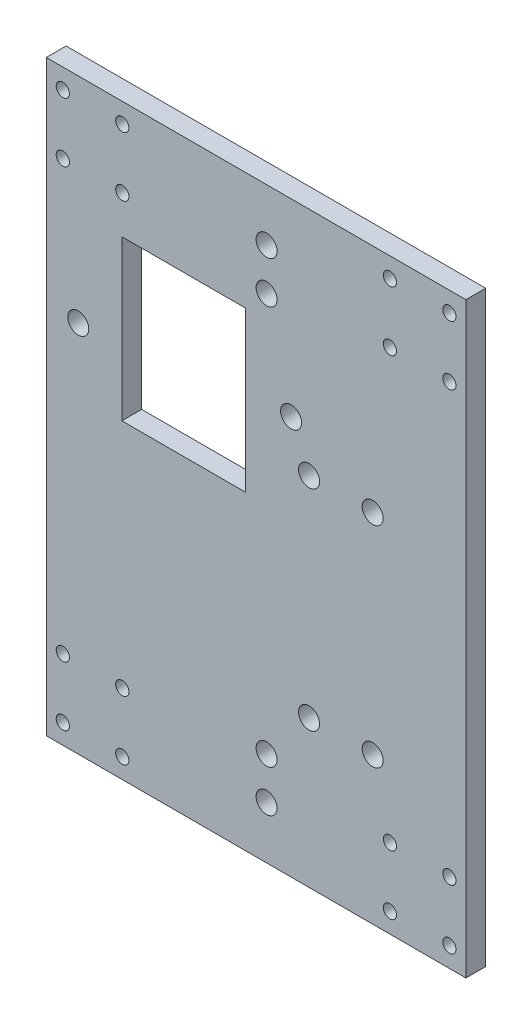
ISO-10303-21;
HEADER;
FILE_DESCRIPTION(('STEP AP214'),'2;1');
FILE_NAME('part.step','',(''),(''),'','','');
FILE_SCHEMA(('AUTOMOTIVE_DESIGN { 1 0 10303 214 1 1 1 1 }'));
ENDSEC;
DATA;
#1=APPLICATION_CONTEXT('core data for automotive mechanical design processes');
#2=APPLICATION_PROTOCOL_DEFINITION('international standard','automotive_design',2000,#1);
#3=PRODUCT_CONTEXT('',#1,'mechanical');
#4=PRODUCT('Part','Part','',(#3));
#5=PRODUCT_RELATED_PRODUCT_CATEGORY('part','',(#4));
#6=PRODUCT_DEFINITION_FORMATION('','',#4);
#7=PRODUCT_DEFINITION_CONTEXT('part definition',#1,'design');
#8=PRODUCT_DEFINITION('design','',#6,#7);
#9=PRODUCT_DEFINITION_SHAPE('','',#8);
#10=(LENGTH_UNIT() NAMED_UNIT(*) SI_UNIT(.MILLI.,.METRE.));
#11=(NAMED_UNIT(*) PLANE_ANGLE_UNIT() SI_UNIT($,.RADIAN.));
#12=(NAMED_UNIT(*) SI_UNIT($,.STERADIAN.) SOLID_ANGLE_UNIT());
#13=UNCERTAINTY_MEASURE_WITH_UNIT(LENGTH_MEASURE(1.E-05),#10,'distance_accuracy_value','');
#14=(GEOMETRIC_REPRESENTATION_CONTEXT(3) GLOBAL_UNCERTAINTY_ASSIGNED_CONTEXT((#13)) GLOBAL_UNIT_ASSIGNED_CONTEXT((#10,
#11,#12)) REPRESENTATION_CONTEXT('',''));
#15=CARTESIAN_POINT('',(0.,0.,0.));
#16=DIRECTION('',(0.,0.,1.));
#17=DIRECTION('',(1.,0.,0.));
#18=AXIS2_PLACEMENT_3D('',#15,#16,#17);
#19=CARTESIAN_POINT('',(0.,0.,5.9944));
#20=DIRECTION('',(0.,0.,-1.));
#21=DIRECTION('',(-1.,0.,0.));
#22=AXIS2_PLACEMENT_3D('',#19,#20,#21);
#23=PLANE('',#22);
#24=CARTESIAN_POINT('',(66.675,149.225,5.9944));
#25=DIRECTION('',(0.,0.,1.));
#26=DIRECTION('',(1.,0.,0.));
#27=AXIS2_PLACEMENT_3D('',#24,#25,#26);
#28=CIRCLE('',#27,3.175);
#29=CARTESIAN_POINT('',(69.85,149.225,5.9944));
#30=VERTEX_POINT('',#29);
#31=EDGE_CURVE('E373',#30,#30,#28,.T.);
#32=ORIENTED_EDGE('',*,*,#31,.F.);
#33=EDGE_LOOP('',(#32));
#34=FACE_BOUND('',#33,.T.);
#35=CARTESIAN_POINT('',(66.675,15.875,5.9944));
#36=DIRECTION('',(0.,0.,1.));
#37=DIRECTION('',(1.,0.,0.));
#38=AXIS2_PLACEMENT_3D('',#35,#36,#37);
#39=CIRCLE('',#38,3.175);
#40=CARTESIAN_POINT('',(69.85,15.875,5.9944));
#41=VERTEX_POINT('',#40);
#42=EDGE_CURVE('E383',#41,#41,#39,.T.);
#43=ORIENTED_EDGE('',*,*,#42,.F.);
#44=EDGE_LOOP('',(#43));
#45=FACE_BOUND('',#44,.T.);
#46=CARTESIAN_POINT('',(9.6774,113.03,5.9944));
#47=DIRECTION('',(0.,0.,1.));
#48=DIRECTION('',(1.,0.,0.));
#49=AXIS2_PLACEMENT_3D('',#46,#47,#48);
#50=CIRCLE('',#49,3.175);
#51=CARTESIAN_POINT('',(12.8524,113.03,5.9944));
#52=VERTEX_POINT('',#51);
#53=EDGE_CURVE('E126',#52,#52,#50,.T.);
#54=ORIENTED_EDGE('',*,*,#53,.F.);
#55=EDGE_LOOP('',(#54));
#56=FACE_BOUND('',#55,.T.);
#57=CARTESIAN_POINT('',(98.7806,107.95,5.9944));
#58=DIRECTION('',(0.,0.,1.));
#59=DIRECTION('',(1.,0.,0.));
#60=AXIS2_PLACEMENT_3D('',#57,#58,#59);
#61=CIRCLE('',#60,3.175);
#62=CARTESIAN_POINT('',(101.9556,107.95,5.9944));
#63=VERTEX_POINT('',#62);
#64=EDGE_CURVE('E136',#63,#63,#61,.T.);
#65=ORIENTED_EDGE('',*,*,#64,.F.);
#66=EDGE_LOOP('',(#65));
#67=FACE_BOUND('',#66,.T.);
#68=CARTESIAN_POINT('',(79.5274,44.45,5.9944));
#69=DIRECTION('',(0.,0.,1.));
#70=DIRECTION('',(1.,0.,0.));
#71=AXIS2_PLACEMENT_3D('',#68,#69,#70);
#72=CIRCLE('',#71,3.175);
#73=CARTESIAN_POINT('',(82.7024,44.45,5.9944));
#74=VERTEX_POINT('',#73);
#75=EDGE_CURVE('E148',#74,#74,#72,.T.);
#76=ORIENTED_EDGE('',*,*,#75,.F.);
#77=EDGE_LOOP('',(#76));
#78=FACE_BOUND('',#77,.T.);
#79=CARTESIAN_POINT('',(122.,6.,5.9944));
#80=DIRECTION('',(0.,0.,1.));
#81=DIRECTION('',(1.,0.,0.));
#82=AXIS2_PLACEMENT_3D('',#79,#80,#81);
#83=CIRCLE('',#82,2.);
#84=CARTESIAN_POINT('',(124.,6.,5.9944));
#85=VERTEX_POINT('',#84);
#86=EDGE_CURVE('E160',#85,#85,#83,.T.);
#87=ORIENTED_EDGE('',*,*,#86,.F.);
#88=EDGE_LOOP('',(#87));
#89=FACE_BOUND('',#88,.T.);
#90=CARTESIAN_POINT('',(104.,24.,5.9944));
#91=DIRECTION('',(0.,0.,1.));
#92=DIRECTION('',(1.,0.,0.));
#93=AXIS2_PLACEMENT_3D('',#90,#91,#92);
#94=CIRCLE('',#93,2.);
#95=CARTESIAN_POINT('',(106.,24.,5.9944));
#96=VERTEX_POINT('',#95);
#97=EDGE_CURVE('E172',#96,#96,#94,.T.);
#98=ORIENTED_EDGE('',*,*,#97,.F.);
#99=EDGE_LOOP('',(#98));
#100=FACE_BOUND('',#99,.T.);
#101=CARTESIAN_POINT('',(23.,6.,5.9944));
#102=DIRECTION('',(0.,0.,1.));
#103=DIRECTION('',(1.,0.,0.));
#104=AXIS2_PLACEMENT_3D('',#101,#102,#103);
#105=CIRCLE('',#104,2.);
#106=CARTESIAN_POINT('',(25.,6.,5.9944));
#107=VERTEX_POINT('',#106);
#108=EDGE_CURVE('E184',#107,#107,#105,.T.);
#109=ORIENTED_EDGE('',*,*,#108,.F.);
#110=EDGE_LOOP('',(#109));
#111=FACE_BOUND('',#110,.T.);
#112=CARTESIAN_POINT('',(5.,24.,5.9944));
#113=DIRECTION('',(0.,0.,1.));
#114=DIRECTION('',(1.,0.,0.));
#115=AXIS2_PLACEMENT_3D('',#112,#113,#114);
#116=CIRCLE('',#115,2.);
#117=CARTESIAN_POINT('',(7.,24.,5.9944));
#118=VERTEX_POINT('',#117);
#119=EDGE_CURVE('E196',#118,#118,#116,.T.);
#120=ORIENTED_EDGE('',*,*,#119,.F.);
#121=EDGE_LOOP('',(#120));
#122=FACE_BOUND('',#121,.T.);
#123=CARTESIAN_POINT('',(122.,153.8,5.9944));
#124=DIRECTION('',(0.,0.,1.));
#125=DIRECTION('',(1.,0.,0.));
#126=AXIS2_PLACEMENT_3D('',#123,#124,#125);
#127=CIRCLE('',#126,2.);
#128=CARTESIAN_POINT('',(124.,153.8,5.9944));
#129=VERTEX_POINT('',#128);
#130=EDGE_CURVE('E208',#129,#129,#127,.T.);
#131=ORIENTED_EDGE('',*,*,#130,.F.);
#132=EDGE_LOOP('',(#131));
#133=FACE_BOUND('',#132,.T.);
#134=CARTESIAN_POINT('',(122.,171.8,5.9944));
#135=DIRECTION('',(0.,0.,1.));
#136=DIRECTION('',(1.,0.,0.));
#137=AXIS2_PLACEMENT_3D('',#134,#135,#136);
#138=CIRCLE('',#137,2.);
#139=CARTESIAN_POINT('',(124.,171.8,5.9944));
#140=VERTEX_POINT('',#139);
#141=EDGE_CURVE('E220',#140,#140,#138,.T.);
#142=ORIENTED_EDGE('',*,*,#141,.F.);
#143=EDGE_LOOP('',(#142));
#144=FACE_BOUND('',#143,.T.);
#145=CARTESIAN_POINT('',(23.,153.8,5.9944));
#146=DIRECTION('',(0.,0.,1.));
#147=DIRECTION('',(1.,0.,0.));
#148=AXIS2_PLACEMENT_3D('',#145,#146,#147);
#149=CIRCLE('',#148,2.00000000000001);
#150=CARTESIAN_POINT('',(25.,153.8,5.9944));
#151=VERTEX_POINT('',#150);
#152=EDGE_CURVE('E232',#151,#151,#149,.T.);
#153=ORIENTED_EDGE('',*,*,#152,.F.);
#154=EDGE_LOOP('',(#153));
#155=FACE_BOUND('',#154,.T.);
#156=CARTESIAN_POINT('',(23.,171.8,5.9944));
#157=DIRECTION('',(0.,0.,1.));
#158=DIRECTION('',(1.,0.,0.));
#159=AXIS2_PLACEMENT_3D('',#156,#157,#158);
#160=CIRCLE('',#159,2.00000000000001);
#161=CARTESIAN_POINT('',(25.,171.8,5.9944));
#162=VERTEX_POINT('',#161);
#163=EDGE_CURVE('E244',#162,#162,#160,.T.);
#164=ORIENTED_EDGE('',*,*,#163,.F.);
#165=EDGE_LOOP('',(#164));
#166=FACE_BOUND('',#165,.T.);
#167=DIRECTION('',(0.,-1.,0.));
#168=VECTOR('',#167,1.);
#169=CARTESIAN_POINT('',(0.,0.,5.9944));
#170=LINE('',#169,#168);
#171=CARTESIAN_POINT('',(0.,177.8,5.9944));
#172=VERTEX_POINT('',#171);
#173=CARTESIAN_POINT('',(0.,0.,5.9944));
#174=VERTEX_POINT('',#173);
#175=EDGE_CURVE('E256',#172,#174,#170,.T.);
#176=ORIENTED_EDGE('',*,*,#175,.T.);
#177=DIRECTION('',(1.,0.,0.));
#178=VECTOR('',#177,1.);
#179=CARTESIAN_POINT('',(0.,0.,5.9944));
#180=LINE('',#179,#178);
#181=CARTESIAN_POINT('',(127.,0.,5.9944));
#182=VERTEX_POINT('',#181);
#183=EDGE_CURVE('E259',#174,#182,#180,.T.);
#184=ORIENTED_EDGE('',*,*,#183,.T.);
#185=DIRECTION('',(0.,1.,0.));
#186=VECTOR('',#185,1.);
#187=CARTESIAN_POINT('',(127.,0.,5.9944));
#188=LINE('',#187,#186);
#189=CARTESIAN_POINT('',(127.,177.8,5.9944));
#190=VERTEX_POINT('',#189);
#191=EDGE_CURVE('E262',#182,#190,#188,.T.);
#192=ORIENTED_EDGE('',*,*,#191,.T.);
#193=DIRECTION('',(-1.,0.,0.));
#194=VECTOR('',#193,1.);
#195=CARTESIAN_POINT('',(0.,177.8,5.9944));
#196=LINE('',#195,#194);
#197=EDGE_CURVE('E264',#190,#172,#196,.T.);
#198=ORIENTED_EDGE('',*,*,#197,.T.);
#199=EDGE_LOOP('',(#176,#184,#192,#198));
#200=FACE_BOUND('',#199,.T.);
#201=CARTESIAN_POINT('',(5.,171.8,5.9944));
#202=DIRECTION('',(0.,0.,1.));
#203=DIRECTION('',(1.,0.,0.));
#204=AXIS2_PLACEMENT_3D('',#201,#202,#203);
#205=CIRCLE('',#204,2.);
#206=CARTESIAN_POINT('',(7.,171.8,5.9944));
#207=VERTEX_POINT('',#206);
#208=EDGE_CURVE('E250',#207,#207,#205,.T.);
#209=ORIENTED_EDGE('',*,*,#208,.F.);
#210=EDGE_LOOP('',(#209));
#211=FACE_BOUND('',#210,.T.);
#212=CARTESIAN_POINT('',(5.,153.8,5.9944));
#213=DIRECTION('',(0.,0.,1.));
#214=DIRECTION('',(1.,0.,0.));
#215=AXIS2_PLACEMENT_3D('',#212,#213,#214);
#216=CIRCLE('',#215,2.);
#217=CARTESIAN_POINT('',(7.,153.8,5.9944));
#218=VERTEX_POINT('',#217);
#219=EDGE_CURVE('E238',#218,#218,#216,.T.);
#220=ORIENTED_EDGE('',*,*,#219,.F.);
#221=EDGE_LOOP('',(#220));
#222=FACE_BOUND('',#221,.T.);
#223=CARTESIAN_POINT('',(104.,171.8,5.9944));
#224=DIRECTION('',(0.,0.,1.));
#225=DIRECTION('',(1.,0.,0.));
#226=AXIS2_PLACEMENT_3D('',#223,#224,#225);
#227=CIRCLE('',#226,2.);
#228=CARTESIAN_POINT('',(106.,171.8,5.9944));
#229=VERTEX_POINT('',#228);
#230=EDGE_CURVE('E226',#229,#229,#227,.T.);
#231=ORIENTED_EDGE('',*,*,#230,.F.);
#232=EDGE_LOOP('',(#231));
#233=FACE_BOUND('',#232,.T.);
#234=CARTESIAN_POINT('',(104.,153.8,5.9944));
#235=DIRECTION('',(0.,0.,1.));
#236=DIRECTION('',(1.,0.,0.));
#237=AXIS2_PLACEMENT_3D('',#234,#235,#236);
#238=CIRCLE('',#237,2.);
#239=CARTESIAN_POINT('',(106.,153.8,5.9944));
#240=VERTEX_POINT('',#239);
#241=EDGE_CURVE('E214',#240,#240,#238,.T.);
#242=ORIENTED_EDGE('',*,*,#241,.F.);
#243=EDGE_LOOP('',(#242));
#244=FACE_BOUND('',#243,.T.);
#245=CARTESIAN_POINT('',(23.,24.,5.9944));
#246=DIRECTION('',(0.,0.,1.));
#247=DIRECTION('',(1.,0.,0.));
#248=AXIS2_PLACEMENT_3D('',#245,#246,#247);
#249=CIRCLE('',#248,2.);
#250=CARTESIAN_POINT('',(25.,24.,5.9944));
#251=VERTEX_POINT('',#250);
#252=EDGE_CURVE('E202',#251,#251,#249,.T.);
#253=ORIENTED_EDGE('',*,*,#252,.F.);
#254=EDGE_LOOP('',(#253));
#255=FACE_BOUND('',#254,.T.);
#256=CARTESIAN_POINT('',(5.,6.,5.9944));
#257=DIRECTION('',(0.,0.,1.));
#258=DIRECTION('',(1.,0.,0.));
#259=AXIS2_PLACEMENT_3D('',#256,#257,#258);
#260=CIRCLE('',#259,2.);
#261=CARTESIAN_POINT('',(7.,6.,5.9944));
#262=VERTEX_POINT('',#261);
#263=EDGE_CURVE('E190',#262,#262,#260,.T.);
#264=ORIENTED_EDGE('',*,*,#263,.F.);
#265=EDGE_LOOP('',(#264));
#266=FACE_BOUND('',#265,.T.);
#267=CARTESIAN_POINT('',(122.,24.,5.9944));
#268=DIRECTION('',(0.,0.,1.));
#269=DIRECTION('',(1.,0.,0.));
#270=AXIS2_PLACEMENT_3D('',#267,#268,#269);
#271=CIRCLE('',#270,2.);
#272=CARTESIAN_POINT('',(124.,24.,5.9944));
#273=VERTEX_POINT('',#272);
#274=EDGE_CURVE('E178',#273,#273,#271,.T.);
#275=ORIENTED_EDGE('',*,*,#274,.F.);
#276=EDGE_LOOP('',(#275));
#277=FACE_BOUND('',#276,.T.);
#278=CARTESIAN_POINT('',(104.,6.,5.9944));
#279=DIRECTION('',(0.,0.,1.));
#280=DIRECTION('',(1.,0.,0.));
#281=AXIS2_PLACEMENT_3D('',#278,#279,#280);
#282=CIRCLE('',#281,2.);
#283=CARTESIAN_POINT('',(106.,6.,5.9944));
#284=VERTEX_POINT('',#283);
#285=EDGE_CURVE('E166',#284,#284,#282,.T.);
#286=ORIENTED_EDGE('',*,*,#285,.F.);
#287=EDGE_LOOP('',(#286));
#288=FACE_BOUND('',#287,.T.);
#289=CARTESIAN_POINT('',(98.7806,44.45,5.9944));
#290=DIRECTION('',(0.,0.,1.));
#291=DIRECTION('',(1.,0.,0.));
#292=AXIS2_PLACEMENT_3D('',#289,#290,#291);
#293=CIRCLE('',#292,3.175);
#294=CARTESIAN_POINT('',(101.9556,44.45,5.9944));
#295=VERTEX_POINT('',#294);
#296=EDGE_CURVE('E154',#295,#295,#293,.T.);
#297=ORIENTED_EDGE('',*,*,#296,.F.);
#298=EDGE_LOOP('',(#297));
#299=FACE_BOUND('',#298,.T.);
#300=CARTESIAN_POINT('',(79.5274,107.95,5.9944));
#301=DIRECTION('',(0.,0.,1.));
#302=DIRECTION('',(1.,0.,0.));
#303=AXIS2_PLACEMENT_3D('',#300,#301,#302);
#304=CIRCLE('',#303,3.175);
#305=CARTESIAN_POINT('',(82.7024,107.95,5.9944));
#306=VERTEX_POINT('',#305);
#307=EDGE_CURVE('E142',#306,#306,#304,.T.);
#308=ORIENTED_EDGE('',*,*,#307,.F.);
#309=EDGE_LOOP('',(#308));
#310=FACE_BOUND('',#309,.T.);
#311=DIRECTION('',(0.,-1.,0.));
#312=VECTOR('',#311,1.);
#313=CARTESIAN_POINT('',(22.86,142.24,5.9944));
#314=LINE('',#313,#312);
#315=CARTESIAN_POINT('',(22.86,142.24,5.9944));
#316=VERTEX_POINT('',#315);
#317=CARTESIAN_POINT('',(22.86,93.98,5.9944));
#318=VERTEX_POINT('',#317);
#319=EDGE_CURVE('E97',#316,#318,#314,.T.);
#320=ORIENTED_EDGE('',*,*,#319,.F.);
#321=DIRECTION('',(-1.,0.,0.));
#322=VECTOR('',#321,1.);
#323=CARTESIAN_POINT('',(22.86,142.24,5.9944));
#324=LINE('',#323,#322);
#325=CARTESIAN_POINT('',(60.325,142.24,5.9944));
#326=VERTEX_POINT('',#325);
#327=EDGE_CURVE('E120',#326,#316,#324,.T.);
#328=ORIENTED_EDGE('',*,*,#327,.F.);
#329=DIRECTION('',(0.,1.,0.));
#330=VECTOR('',#329,1.);
#331=CARTESIAN_POINT('',(60.325,142.24,5.9944));
#332=LINE('',#331,#330);
#333=CARTESIAN_POINT('',(60.325,93.98,5.9944));
#334=VERTEX_POINT('',#333);
#335=EDGE_CURVE('E118',#334,#326,#332,.T.);
#336=ORIENTED_EDGE('',*,*,#335,.F.);
#337=DIRECTION('',(1.,0.,0.));
#338=VECTOR('',#337,1.);
#339=CARTESIAN_POINT('',(22.86,93.98,5.9944));
#340=LINE('',#339,#338);
#341=EDGE_CURVE('E105',#318,#334,#340,.T.);
#342=ORIENTED_EDGE('',*,*,#341,.F.);
#343=EDGE_LOOP('',(#320,#328,#336,#342));
#344=FACE_BOUND('',#343,.T.);
#345=CARTESIAN_POINT('',(74.0918,120.65,5.9944));
#346=DIRECTION('',(0.,0.,1.));
#347=DIRECTION('',(1.,0.,0.));
#348=AXIS2_PLACEMENT_3D('',#345,#346,#347);
#349=CIRCLE('',#348,3.175);
#350=CARTESIAN_POINT('',(77.2668,120.65,5.9944));
#351=VERTEX_POINT('',#350);
#352=EDGE_CURVE('E388',#351,#351,#349,.T.);
#353=ORIENTED_EDGE('',*,*,#352,.F.);
#354=EDGE_LOOP('',(#353));
#355=FACE_BOUND('',#354,.T.);
#356=CARTESIAN_POINT('',(66.675,161.925,5.9944));
#357=DIRECTION('',(0.,0.,1.));
#358=DIRECTION('',(1.,0.,0.));
#359=AXIS2_PLACEMENT_3D('',#356,#357,#358);
#360=CIRCLE('',#359,3.175);
#361=CARTESIAN_POINT('',(69.85,161.925,5.9944));
#362=VERTEX_POINT('',#361);
#363=EDGE_CURVE('E378',#362,#362,#360,.T.);
#364=ORIENTED_EDGE('',*,*,#363,.F.);
#365=EDGE_LOOP('',(#364));
#366=FACE_BOUND('',#365,.T.);
#367=CARTESIAN_POINT('',(66.675,28.575,5.9944));
#368=DIRECTION('',(0.,0.,1.));
#369=DIRECTION('',(1.,0.,0.));
#370=AXIS2_PLACEMENT_3D('',#367,#368,#369);
#371=CIRCLE('',#370,3.175);
#372=CARTESIAN_POINT('',(69.85,28.575,5.9944));
#373=VERTEX_POINT('',#372);
#374=EDGE_CURVE('E367',#373,#373,#371,.T.);
#375=ORIENTED_EDGE('',*,*,#374,.F.);
#376=EDGE_LOOP('',(#375));
#377=FACE_BOUND('',#376,.T.);
#378=ADVANCED_FACE('F32',(#34,#45,#56,#67,#78,#89,#100,#111,#122,#133,#144,#155,#166,#200,#211,
#222,#233,#244,#255,#266,#277,#288,#299,#310,#344,#355,#366,#377),#23,.F.);
#379=CARTESIAN_POINT('',(0.,0.,0.));
#380=DIRECTION('',(0.,0.,-1.));
#381=DIRECTION('',(-1.,0.,0.));
#382=AXIS2_PLACEMENT_3D('',#379,#380,#381);
#383=PLANE('',#382);
#384=CARTESIAN_POINT('',(66.675,149.225,0.));
#385=DIRECTION('',(0.,0.,1.));
#386=DIRECTION('',(1.,0.,0.));
#387=AXIS2_PLACEMENT_3D('',#384,#385,#386);
#388=CIRCLE('',#387,3.175);
#389=CARTESIAN_POINT('',(69.85,149.225,0.));
#390=VERTEX_POINT('',#389);
#391=EDGE_CURVE('E370',#390,#390,#388,.T.);
#392=ORIENTED_EDGE('',*,*,#391,.T.);
#393=EDGE_LOOP('',(#392));
#394=FACE_BOUND('',#393,.T.);
#395=CARTESIAN_POINT('',(66.675,15.875,0.));
#396=DIRECTION('',(0.,0.,1.));
#397=DIRECTION('',(1.,0.,0.));
#398=AXIS2_PLACEMENT_3D('',#395,#396,#397);
#399=CIRCLE('',#398,3.175);
#400=CARTESIAN_POINT('',(69.85,15.875,0.));
#401=VERTEX_POINT('',#400);
#402=EDGE_CURVE('E381',#401,#401,#399,.T.);
#403=ORIENTED_EDGE('',*,*,#402,.T.);
#404=EDGE_LOOP('',(#403));
#405=FACE_BOUND('',#404,.T.);
#406=CARTESIAN_POINT('',(9.6774,113.03,0.));
#407=DIRECTION('',(0.,0.,1.));
#408=DIRECTION('',(1.,0.,0.));
#409=AXIS2_PLACEMENT_3D('',#406,#407,#408);
#410=CIRCLE('',#409,3.175);
#411=CARTESIAN_POINT('',(12.8524,113.03,0.));
#412=VERTEX_POINT('',#411);
#413=EDGE_CURVE('E391',#412,#412,#410,.T.);
#414=ORIENTED_EDGE('',*,*,#413,.T.);
#415=EDGE_LOOP('',(#414));
#416=FACE_BOUND('',#415,.T.);
#417=CARTESIAN_POINT('',(98.7806,107.95,0.));
#418=DIRECTION('',(0.,0.,1.));
#419=DIRECTION('',(1.,0.,0.));
#420=AXIS2_PLACEMENT_3D('',#417,#418,#419);
#421=CIRCLE('',#420,3.175);
#422=CARTESIAN_POINT('',(101.9556,107.95,0.));
#423=VERTEX_POINT('',#422);
#424=EDGE_CURVE('E113',#423,#423,#421,.T.);
#425=ORIENTED_EDGE('',*,*,#424,.T.);
#426=EDGE_LOOP('',(#425));
#427=FACE_BOUND('',#426,.T.);
#428=CARTESIAN_POINT('',(79.5274,44.45,0.));
#429=DIRECTION('',(0.,0.,1.));
#430=DIRECTION('',(1.,0.,0.));
#431=AXIS2_PLACEMENT_3D('',#428,#429,#430);
#432=CIRCLE('',#431,3.175);
#433=CARTESIAN_POINT('',(82.7024,44.45,0.));
#434=VERTEX_POINT('',#433);
#435=EDGE_CURVE('E145',#434,#434,#432,.T.);
#436=ORIENTED_EDGE('',*,*,#435,.T.);
#437=EDGE_LOOP('',(#436));
#438=FACE_BOUND('',#437,.T.);
#439=CARTESIAN_POINT('',(122.,6.,0.));
#440=DIRECTION('',(0.,0.,1.));
#441=DIRECTION('',(1.,0.,0.));
#442=AXIS2_PLACEMENT_3D('',#439,#440,#441);
#443=CIRCLE('',#442,2.);
#444=CARTESIAN_POINT('',(124.,6.,0.));
#445=VERTEX_POINT('',#444);
#446=EDGE_CURVE('E157',#445,#445,#443,.T.);
#447=ORIENTED_EDGE('',*,*,#446,.T.);
#448=EDGE_LOOP('',(#447));
#449=FACE_BOUND('',#448,.T.);
#450=CARTESIAN_POINT('',(104.,24.,0.));
#451=DIRECTION('',(0.,0.,1.));
#452=DIRECTION('',(1.,0.,0.));
#453=AXIS2_PLACEMENT_3D('',#450,#451,#452);
#454=CIRCLE('',#453,2.);
#455=CARTESIAN_POINT('',(106.,24.,0.));
#456=VERTEX_POINT('',#455);
#457=EDGE_CURVE('E169',#456,#456,#454,.T.);
#458=ORIENTED_EDGE('',*,*,#457,.T.);
#459=EDGE_LOOP('',(#458));
#460=FACE_BOUND('',#459,.T.);
#461=CARTESIAN_POINT('',(23.,6.,0.));
#462=DIRECTION('',(0.,0.,1.));
#463=DIRECTION('',(1.,0.,0.));
#464=AXIS2_PLACEMENT_3D('',#461,#462,#463);
#465=CIRCLE('',#464,2.);
#466=CARTESIAN_POINT('',(25.,6.,0.));
#467=VERTEX_POINT('',#466);
#468=EDGE_CURVE('E181',#467,#467,#465,.T.);
#469=ORIENTED_EDGE('',*,*,#468,.T.);
#470=EDGE_LOOP('',(#469));
#471=FACE_BOUND('',#470,.T.);
#472=CARTESIAN_POINT('',(5.,24.,0.));
#473=DIRECTION('',(0.,0.,1.));
#474=DIRECTION('',(1.,0.,0.));
#475=AXIS2_PLACEMENT_3D('',#472,#473,#474);
#476=CIRCLE('',#475,2.);
#477=CARTESIAN_POINT('',(7.,24.,0.));
#478=VERTEX_POINT('',#477);
#479=EDGE_CURVE('E193',#478,#478,#476,.T.);
#480=ORIENTED_EDGE('',*,*,#479,.T.);
#481=EDGE_LOOP('',(#480));
#482=FACE_BOUND('',#481,.T.);
#483=CARTESIAN_POINT('',(122.,153.8,0.));
#484=DIRECTION('',(0.,0.,1.));
#485=DIRECTION('',(1.,0.,0.));
#486=AXIS2_PLACEMENT_3D('',#483,#484,#485);
#487=CIRCLE('',#486,2.);
#488=CARTESIAN_POINT('',(124.,153.8,0.));
#489=VERTEX_POINT('',#488);
#490=EDGE_CURVE('E205',#489,#489,#487,.T.);
#491=ORIENTED_EDGE('',*,*,#490,.T.);
#492=EDGE_LOOP('',(#491));
#493=FACE_BOUND('',#492,.T.);
#494=CARTESIAN_POINT('',(122.,171.8,0.));
#495=DIRECTION('',(0.,0.,1.));
#496=DIRECTION('',(1.,0.,0.));
#497=AXIS2_PLACEMENT_3D('',#494,#495,#496);
#498=CIRCLE('',#497,2.);
#499=CARTESIAN_POINT('',(124.,171.8,0.));
#500=VERTEX_POINT('',#499);
#501=EDGE_CURVE('E217',#500,#500,#498,.T.);
#502=ORIENTED_EDGE('',*,*,#501,.T.);
#503=EDGE_LOOP('',(#502));
#504=FACE_BOUND('',#503,.T.);
#505=CARTESIAN_POINT('',(23.,153.8,0.));
#506=DIRECTION('',(0.,0.,1.));
#507=DIRECTION('',(1.,0.,0.));
#508=AXIS2_PLACEMENT_3D('',#505,#506,#507);
#509=CIRCLE('',#508,2.00000000000001);
#510=CARTESIAN_POINT('',(25.,153.8,0.));
#511=VERTEX_POINT('',#510);
#512=EDGE_CURVE('E229',#511,#511,#509,.T.);
#513=ORIENTED_EDGE('',*,*,#512,.T.);
#514=EDGE_LOOP('',(#513));
#515=FACE_BOUND('',#514,.T.);
#516=CARTESIAN_POINT('',(23.,171.8,0.));
#517=DIRECTION('',(0.,0.,1.));
#518=DIRECTION('',(1.,0.,0.));
#519=AXIS2_PLACEMENT_3D('',#516,#517,#518);
#520=CIRCLE('',#519,2.00000000000001);
#521=CARTESIAN_POINT('',(25.,171.8,0.));
#522=VERTEX_POINT('',#521);
#523=EDGE_CURVE('E241',#522,#522,#520,.T.);
#524=ORIENTED_EDGE('',*,*,#523,.T.);
#525=EDGE_LOOP('',(#524));
#526=FACE_BOUND('',#525,.T.);
#527=DIRECTION('',(0.,-1.,0.));
#528=VECTOR('',#527,1.);
#529=CARTESIAN_POINT('',(0.,0.,0.));
#530=LINE('',#529,#528);
#531=CARTESIAN_POINT('',(0.,177.8,0.));
#532=VERTEX_POINT('',#531);
#533=CARTESIAN_POINT('',(0.,0.,0.));
#534=VERTEX_POINT('',#533);
#535=EDGE_CURVE('E253',#532,#534,#530,.T.);
#536=ORIENTED_EDGE('',*,*,#535,.F.);
#537=DIRECTION('',(-1.,0.,0.));
#538=VECTOR('',#537,1.);
#539=CARTESIAN_POINT('',(0.,177.8,0.));
#540=LINE('',#539,#538);
#541=CARTESIAN_POINT('',(127.,177.8,0.));
#542=VERTEX_POINT('',#541);
#543=EDGE_CURVE('E260',#542,#532,#540,.T.);
#544=ORIENTED_EDGE('',*,*,#543,.F.);
#545=DIRECTION('',(0.,1.,0.));
#546=VECTOR('',#545,1.);
#547=CARTESIAN_POINT('',(127.,0.,0.));
#548=LINE('',#547,#546);
#549=CARTESIAN_POINT('',(127.,0.,0.));
#550=VERTEX_POINT('',#549);
#551=EDGE_CURVE('E271',#550,#542,#548,.T.);
#552=ORIENTED_EDGE('',*,*,#551,.F.);
#553=DIRECTION('',(1.,0.,0.));
#554=VECTOR('',#553,1.);
#555=CARTESIAN_POINT('',(0.,0.,0.));
#556=LINE('',#555,#554);
#557=EDGE_CURVE('E269',#534,#550,#556,.T.);
#558=ORIENTED_EDGE('',*,*,#557,.F.);
#559=EDGE_LOOP('',(#536,#544,#552,#558));
#560=FACE_BOUND('',#559,.T.);
#561=CARTESIAN_POINT('',(5.,171.8,0.));
#562=DIRECTION('',(0.,0.,1.));
#563=DIRECTION('',(1.,0.,0.));
#564=AXIS2_PLACEMENT_3D('',#561,#562,#563);
#565=CIRCLE('',#564,2.);
#566=CARTESIAN_POINT('',(7.,171.8,0.));
#567=VERTEX_POINT('',#566);
#568=EDGE_CURVE('E247',#567,#567,#565,.T.);
#569=ORIENTED_EDGE('',*,*,#568,.T.);
#570=EDGE_LOOP('',(#569));
#571=FACE_BOUND('',#570,.T.);
#572=CARTESIAN_POINT('',(5.,153.8,0.));
#573=DIRECTION('',(0.,0.,1.));
#574=DIRECTION('',(1.,0.,0.));
#575=AXIS2_PLACEMENT_3D('',#572,#573,#574);
#576=CIRCLE('',#575,2.);
#577=CARTESIAN_POINT('',(7.,153.8,0.));
#578=VERTEX_POINT('',#577);
#579=EDGE_CURVE('E235',#578,#578,#576,.T.);
#580=ORIENTED_EDGE('',*,*,#579,.T.);
#581=EDGE_LOOP('',(#580));
#582=FACE_BOUND('',#581,.T.);
#583=CARTESIAN_POINT('',(104.,171.8,0.));
#584=DIRECTION('',(0.,0.,1.));
#585=DIRECTION('',(1.,0.,0.));
#586=AXIS2_PLACEMENT_3D('',#583,#584,#585);
#587=CIRCLE('',#586,2.);
#588=CARTESIAN_POINT('',(106.,171.8,0.));
#589=VERTEX_POINT('',#588);
#590=EDGE_CURVE('E223',#589,#589,#587,.T.);
#591=ORIENTED_EDGE('',*,*,#590,.T.);
#592=EDGE_LOOP('',(#591));
#593=FACE_BOUND('',#592,.T.);
#594=CARTESIAN_POINT('',(104.,153.8,0.));
#595=DIRECTION('',(0.,0.,1.));
#596=DIRECTION('',(1.,0.,0.));
#597=AXIS2_PLACEMENT_3D('',#594,#595,#596);
#598=CIRCLE('',#597,2.);
#599=CARTESIAN_POINT('',(106.,153.8,0.));
#600=VERTEX_POINT('',#599);
#601=EDGE_CURVE('E211',#600,#600,#598,.T.);
#602=ORIENTED_EDGE('',*,*,#601,.T.);
#603=EDGE_LOOP('',(#602));
#604=FACE_BOUND('',#603,.T.);
#605=CARTESIAN_POINT('',(23.,24.,0.));
#606=DIRECTION('',(0.,0.,1.));
#607=DIRECTION('',(1.,0.,0.));
#608=AXIS2_PLACEMENT_3D('',#605,#606,#607);
#609=CIRCLE('',#608,2.);
#610=CARTESIAN_POINT('',(25.,24.,0.));
#611=VERTEX_POINT('',#610);
#612=EDGE_CURVE('E199',#611,#611,#609,.T.);
#613=ORIENTED_EDGE('',*,*,#612,.T.);
#614=EDGE_LOOP('',(#613));
#615=FACE_BOUND('',#614,.T.);
#616=CARTESIAN_POINT('',(5.,6.,0.));
#617=DIRECTION('',(0.,0.,1.));
#618=DIRECTION('',(1.,0.,0.));
#619=AXIS2_PLACEMENT_3D('',#616,#617,#618);
#620=CIRCLE('',#619,2.);
#621=CARTESIAN_POINT('',(7.,6.,0.));
#622=VERTEX_POINT('',#621);
#623=EDGE_CURVE('E187',#622,#622,#620,.T.);
#624=ORIENTED_EDGE('',*,*,#623,.T.);
#625=EDGE_LOOP('',(#624));
#626=FACE_BOUND('',#625,.T.);
#627=CARTESIAN_POINT('',(122.,24.,0.));
#628=DIRECTION('',(0.,0.,1.));
#629=DIRECTION('',(1.,0.,0.));
#630=AXIS2_PLACEMENT_3D('',#627,#628,#629);
#631=CIRCLE('',#630,2.);
#632=CARTESIAN_POINT('',(124.,24.,0.));
#633=VERTEX_POINT('',#632);
#634=EDGE_CURVE('E175',#633,#633,#631,.T.);
#635=ORIENTED_EDGE('',*,*,#634,.T.);
#636=EDGE_LOOP('',(#635));
#637=FACE_BOUND('',#636,.T.);
#638=CARTESIAN_POINT('',(104.,6.,0.));
#639=DIRECTION('',(0.,0.,1.));
#640=DIRECTION('',(1.,0.,0.));
#641=AXIS2_PLACEMENT_3D('',#638,#639,#640);
#642=CIRCLE('',#641,2.);
#643=CARTESIAN_POINT('',(106.,6.,0.));
#644=VERTEX_POINT('',#643);
#645=EDGE_CURVE('E163',#644,#644,#642,.T.);
#646=ORIENTED_EDGE('',*,*,#645,.T.);
#647=EDGE_LOOP('',(#646));
#648=FACE_BOUND('',#647,.T.);
#649=CARTESIAN_POINT('',(98.7806,44.45,0.));
#650=DIRECTION('',(0.,0.,1.));
#651=DIRECTION('',(1.,0.,0.));
#652=AXIS2_PLACEMENT_3D('',#649,#650,#651);
#653=CIRCLE('',#652,3.175);
#654=CARTESIAN_POINT('',(101.9556,44.45,0.));
#655=VERTEX_POINT('',#654);
#656=EDGE_CURVE('E151',#655,#655,#653,.T.);
#657=ORIENTED_EDGE('',*,*,#656,.T.);
#658=EDGE_LOOP('',(#657));
#659=FACE_BOUND('',#658,.T.);
#660=CARTESIAN_POINT('',(79.5274,107.95,0.));
#661=DIRECTION('',(0.,0.,1.));
#662=DIRECTION('',(1.,0.,0.));
#663=AXIS2_PLACEMENT_3D('',#660,#661,#662);
#664=CIRCLE('',#663,3.175);
#665=CARTESIAN_POINT('',(82.7024,107.95,0.));
#666=VERTEX_POINT('',#665);
#667=EDGE_CURVE('E139',#666,#666,#664,.T.);
#668=ORIENTED_EDGE('',*,*,#667,.T.);
#669=EDGE_LOOP('',(#668));
#670=FACE_BOUND('',#669,.T.);
#671=DIRECTION('',(-1.,0.,0.));
#672=VECTOR('',#671,1.);
#673=CARTESIAN_POINT('',(22.86,142.24,0.));
#674=LINE('',#673,#672);
#675=CARTESIAN_POINT('',(60.325,142.24,0.));
#676=VERTEX_POINT('',#675);
#677=CARTESIAN_POINT('',(22.86,142.24,0.));
#678=VERTEX_POINT('',#677);
#679=EDGE_CURVE('E106',#676,#678,#674,.T.);
#680=ORIENTED_EDGE('',*,*,#679,.T.);
#681=DIRECTION('',(0.,-1.,0.));
#682=VECTOR('',#681,1.);
#683=CARTESIAN_POINT('',(22.86,142.24,0.));
#684=LINE('',#683,#682);
#685=CARTESIAN_POINT('',(22.86,93.98,0.));
#686=VERTEX_POINT('',#685);
#687=EDGE_CURVE('E55',#678,#686,#684,.T.);
#688=ORIENTED_EDGE('',*,*,#687,.T.);
#689=DIRECTION('',(1.,0.,0.));
#690=VECTOR('',#689,1.);
#691=CARTESIAN_POINT('',(22.86,93.98,0.));
#692=LINE('',#691,#690);
#693=CARTESIAN_POINT('',(60.325,93.98,0.));
#694=VERTEX_POINT('',#693);
#695=EDGE_CURVE('E112',#686,#694,#692,.T.);
#696=ORIENTED_EDGE('',*,*,#695,.T.);
#697=DIRECTION('',(0.,1.,0.));
#698=VECTOR('',#697,1.);
#699=CARTESIAN_POINT('',(60.325,142.24,0.));
#700=LINE('',#699,#698);
#701=EDGE_CURVE('E128',#694,#676,#700,.T.);
#702=ORIENTED_EDGE('',*,*,#701,.T.);
#703=EDGE_LOOP('',(#680,#688,#696,#702));
#704=FACE_BOUND('',#703,.T.);
#705=CARTESIAN_POINT('',(74.0918,120.65,0.));
#706=DIRECTION('',(0.,0.,1.));
#707=DIRECTION('',(1.,0.,0.));
#708=AXIS2_PLACEMENT_3D('',#705,#706,#707);
#709=CIRCLE('',#708,3.175);
#710=CARTESIAN_POINT('',(77.2668,120.65,0.));
#711=VERTEX_POINT('',#710);
#712=EDGE_CURVE('E358',#711,#711,#709,.T.);
#713=ORIENTED_EDGE('',*,*,#712,.T.);
#714=EDGE_LOOP('',(#713));
#715=FACE_BOUND('',#714,.T.);
#716=CARTESIAN_POINT('',(66.675,161.925,0.));
#717=DIRECTION('',(0.,0.,1.));
#718=DIRECTION('',(1.,0.,0.));
#719=AXIS2_PLACEMENT_3D('',#716,#717,#718);
#720=CIRCLE('',#719,3.175);
#721=CARTESIAN_POINT('',(69.85,161.925,0.));
#722=VERTEX_POINT('',#721);
#723=EDGE_CURVE('E362',#722,#722,#720,.T.);
#724=ORIENTED_EDGE('',*,*,#723,.T.);
#725=EDGE_LOOP('',(#724));
#726=FACE_BOUND('',#725,.T.);
#727=CARTESIAN_POINT('',(66.675,28.575,0.));
#728=DIRECTION('',(0.,0.,1.));
#729=DIRECTION('',(1.,0.,0.));
#730=AXIS2_PLACEMENT_3D('',#727,#728,#729);
#731=CIRCLE('',#730,3.175);
#732=CARTESIAN_POINT('',(69.85,28.575,0.));
#733=VERTEX_POINT('',#732);
#734=EDGE_CURVE('E365',#733,#733,#731,.T.);
#735=ORIENTED_EDGE('',*,*,#734,.T.);
#736=EDGE_LOOP('',(#735));
#737=FACE_BOUND('',#736,.T.);
#738=ADVANCED_FACE('F289',(#394,#405,#416,#427,#438,#449,#460,#471,#482,#493,#504,#515,#526,
#560,#571,#582,#593,#604,#615,#626,#637,#648,#659,#670,#704,#715,#726,#737),#383,.T.);
#739=CARTESIAN_POINT('',(0.,0.,5.9944));
#740=DIRECTION('',(1.,0.,0.));
#741=DIRECTION('',(0.,0.,-1.));
#742=AXIS2_PLACEMENT_3D('',#739,#740,#741);
#743=PLANE('',#742);
#744=ORIENTED_EDGE('',*,*,#535,.T.);
#745=DIRECTION('',(0.,0.,-1.));
#746=VECTOR('',#745,1.);
#747=CARTESIAN_POINT('',(0.,0.,5.9944));
#748=LINE('',#747,#746);
#749=EDGE_CURVE('E11',#174,#534,#748,.T.);
#750=ORIENTED_EDGE('',*,*,#749,.F.);
#751=ORIENTED_EDGE('',*,*,#175,.F.);
#752=DIRECTION('',(0.,0.,-1.));
#753=VECTOR('',#752,1.);
#754=CARTESIAN_POINT('',(0.,177.8,5.9944));
#755=LINE('',#754,#753);
#756=EDGE_CURVE('E266',#172,#532,#755,.T.);
#757=ORIENTED_EDGE('',*,*,#756,.T.);
#758=EDGE_LOOP('',(#744,#750,#751,#757));
#759=FACE_BOUND('',#758,.T.);
#760=ADVANCED_FACE('F34',(#759),#743,.F.);
#761=CARTESIAN_POINT('',(0.,0.,5.9944));
#762=DIRECTION('',(0.,1.,0.));
#763=DIRECTION('',(0.,0.,1.));
#764=AXIS2_PLACEMENT_3D('',#761,#762,#763);
#765=PLANE('',#764);
#766=ORIENTED_EDGE('',*,*,#557,.T.);
#767=DIRECTION('',(0.,0.,-1.));
#768=VECTOR('',#767,1.);
#769=CARTESIAN_POINT('',(127.,0.,5.9944));
#770=LINE('',#769,#768);
#771=EDGE_CURVE('E40',#182,#550,#770,.T.);
#772=ORIENTED_EDGE('',*,*,#771,.F.);
#773=ORIENTED_EDGE('',*,*,#183,.F.);
#774=ORIENTED_EDGE('',*,*,#749,.T.);
#775=EDGE_LOOP('',(#766,#772,#773,#774));
#776=FACE_BOUND('',#775,.T.);
#777=ADVANCED_FACE('F300',(#776),#765,.F.);
#778=CARTESIAN_POINT('',(127.,0.,5.9944));
#779=DIRECTION('',(-1.,0.,0.));
#780=DIRECTION('',(0.,0.,1.));
#781=AXIS2_PLACEMENT_3D('',#778,#779,#780);
#782=PLANE('',#781);
#783=ORIENTED_EDGE('',*,*,#551,.T.);
#784=DIRECTION('',(0.,0.,-1.));
#785=VECTOR('',#784,1.);
#786=CARTESIAN_POINT('',(127.,177.8,5.9944));
#787=LINE('',#786,#785);
#788=EDGE_CURVE('E276',#190,#542,#787,.T.);
#789=ORIENTED_EDGE('',*,*,#788,.F.);
#790=ORIENTED_EDGE('',*,*,#191,.F.);
#791=ORIENTED_EDGE('',*,*,#771,.T.);
#792=EDGE_LOOP('',(#783,#789,#790,#791));
#793=FACE_BOUND('',#792,.T.);
#794=ADVANCED_FACE('F283',(#793),#782,.F.);
#795=CARTESIAN_POINT('',(0.,177.8,5.9944));
#796=DIRECTION('',(0.,-1.,0.));
#797=DIRECTION('',(0.,0.,-1.));
#798=AXIS2_PLACEMENT_3D('',#795,#796,#797);
#799=PLANE('',#798);
#800=ORIENTED_EDGE('',*,*,#543,.T.);
#801=ORIENTED_EDGE('',*,*,#756,.F.);
#802=ORIENTED_EDGE('',*,*,#197,.F.);
#803=ORIENTED_EDGE('',*,*,#788,.T.);
#804=EDGE_LOOP('',(#800,#801,#802,#803));
#805=FACE_BOUND('',#804,.T.);
#806=ADVANCED_FACE('F293',(#805),#799,.F.);
#807=CARTESIAN_POINT('',(5.,171.8,5.9944));
#808=DIRECTION('',(0.,0.,-1.));
#809=DIRECTION('',(-1.,0.,0.));
#810=AXIS2_PLACEMENT_3D('',#807,#808,#809);
#811=CYLINDRICAL_SURFACE('',#810,2.);
#812=ORIENTED_EDGE('',*,*,#208,.T.);
#813=EDGE_LOOP('',(#812));
#814=FACE_BOUND('',#813,.T.);
#815=ORIENTED_EDGE('',*,*,#568,.F.);
#816=EDGE_LOOP('',(#815));
#817=FACE_BOUND('',#816,.T.);
#818=ADVANCED_FACE('F318',(#814,#817),#811,.F.);
#819=CARTESIAN_POINT('',(23.,171.8,5.9944));
#820=DIRECTION('',(0.,0.,-1.));
#821=DIRECTION('',(-1.,0.,0.));
#822=AXIS2_PLACEMENT_3D('',#819,#820,#821);
#823=CYLINDRICAL_SURFACE('',#822,2.00000000000001);
#824=ORIENTED_EDGE('',*,*,#163,.T.);
#825=EDGE_LOOP('',(#824));
#826=FACE_BOUND('',#825,.T.);
#827=ORIENTED_EDGE('',*,*,#523,.F.);
#828=EDGE_LOOP('',(#827));
#829=FACE_BOUND('',#828,.T.);
#830=ADVANCED_FACE('F325',(#826,#829),#823,.F.);
#831=CARTESIAN_POINT('',(5.,153.8,5.9944));
#832=DIRECTION('',(0.,0.,-1.));
#833=DIRECTION('',(-1.,0.,0.));
#834=AXIS2_PLACEMENT_3D('',#831,#832,#833);
#835=CYLINDRICAL_SURFACE('',#834,2.);
#836=ORIENTED_EDGE('',*,*,#219,.T.);
#837=EDGE_LOOP('',(#836));
#838=FACE_BOUND('',#837,.T.);
#839=ORIENTED_EDGE('',*,*,#579,.F.);
#840=EDGE_LOOP('',(#839));
#841=FACE_BOUND('',#840,.T.);
#842=ADVANCED_FACE('F330',(#838,#841),#835,.F.);
#843=CARTESIAN_POINT('',(23.,153.8,5.9944));
#844=DIRECTION('',(0.,0.,-1.));
#845=DIRECTION('',(-1.,0.,0.));
#846=AXIS2_PLACEMENT_3D('',#843,#844,#845);
#847=CYLINDRICAL_SURFACE('',#846,2.00000000000001);
#848=ORIENTED_EDGE('',*,*,#152,.T.);
#849=EDGE_LOOP('',(#848));
#850=FACE_BOUND('',#849,.T.);
#851=ORIENTED_EDGE('',*,*,#512,.F.);
#852=EDGE_LOOP('',(#851));
#853=FACE_BOUND('',#852,.T.);
#854=ADVANCED_FACE('F486',(#850,#853),#847,.F.);
#855=CARTESIAN_POINT('',(104.,171.8,5.9944));
#856=DIRECTION('',(0.,0.,-1.));
#857=DIRECTION('',(-1.,0.,0.));
#858=AXIS2_PLACEMENT_3D('',#855,#856,#857);
#859=CYLINDRICAL_SURFACE('',#858,2.);
#860=ORIENTED_EDGE('',*,*,#230,.T.);
#861=EDGE_LOOP('',(#860));
#862=FACE_BOUND('',#861,.T.);
#863=ORIENTED_EDGE('',*,*,#590,.F.);
#864=EDGE_LOOP('',(#863));
#865=FACE_BOUND('',#864,.T.);
#866=ADVANCED_FACE('F482',(#862,#865),#859,.F.);
#867=CARTESIAN_POINT('',(122.,171.8,5.9944));
#868=DIRECTION('',(0.,0.,-1.));
#869=DIRECTION('',(-1.,0.,0.));
#870=AXIS2_PLACEMENT_3D('',#867,#868,#869);
#871=CYLINDRICAL_SURFACE('',#870,2.);
#872=ORIENTED_EDGE('',*,*,#141,.T.);
#873=EDGE_LOOP('',(#872));
#874=FACE_BOUND('',#873,.T.);
#875=ORIENTED_EDGE('',*,*,#501,.F.);
#876=EDGE_LOOP('',(#875));
#877=FACE_BOUND('',#876,.T.);
#878=ADVANCED_FACE('F478',(#874,#877),#871,.F.);
#879=CARTESIAN_POINT('',(104.,153.8,5.9944));
#880=DIRECTION('',(0.,0.,-1.));
#881=DIRECTION('',(-1.,0.,0.));
#882=AXIS2_PLACEMENT_3D('',#879,#880,#881);
#883=CYLINDRICAL_SURFACE('',#882,2.);
#884=ORIENTED_EDGE('',*,*,#241,.T.);
#885=EDGE_LOOP('',(#884));
#886=FACE_BOUND('',#885,.T.);
#887=ORIENTED_EDGE('',*,*,#601,.F.);
#888=EDGE_LOOP('',(#887));
#889=FACE_BOUND('',#888,.T.);
#890=ADVANCED_FACE('F474',(#886,#889),#883,.F.);
#891=CARTESIAN_POINT('',(122.,153.8,5.9944));
#892=DIRECTION('',(0.,0.,-1.));
#893=DIRECTION('',(-1.,0.,0.));
#894=AXIS2_PLACEMENT_3D('',#891,#892,#893);
#895=CYLINDRICAL_SURFACE('',#894,2.);
#896=ORIENTED_EDGE('',*,*,#130,.T.);
#897=EDGE_LOOP('',(#896));
#898=FACE_BOUND('',#897,.T.);
#899=ORIENTED_EDGE('',*,*,#490,.F.);
#900=EDGE_LOOP('',(#899));
#901=FACE_BOUND('',#900,.T.);
#902=ADVANCED_FACE('F470',(#898,#901),#895,.F.);
#903=CARTESIAN_POINT('',(23.,24.,5.9944));
#904=DIRECTION('',(0.,0.,-1.));
#905=DIRECTION('',(-1.,0.,0.));
#906=AXIS2_PLACEMENT_3D('',#903,#904,#905);
#907=CYLINDRICAL_SURFACE('',#906,2.);
#908=ORIENTED_EDGE('',*,*,#252,.T.);
#909=EDGE_LOOP('',(#908));
#910=FACE_BOUND('',#909,.T.);
#911=ORIENTED_EDGE('',*,*,#612,.F.);
#912=EDGE_LOOP('',(#911));
#913=FACE_BOUND('',#912,.T.);
#914=ADVANCED_FACE('F466',(#910,#913),#907,.F.);
#915=CARTESIAN_POINT('',(5.,24.,5.9944));
#916=DIRECTION('',(0.,0.,-1.));
#917=DIRECTION('',(-1.,0.,0.));
#918=AXIS2_PLACEMENT_3D('',#915,#916,#917);
#919=CYLINDRICAL_SURFACE('',#918,2.);
#920=ORIENTED_EDGE('',*,*,#119,.T.);
#921=EDGE_LOOP('',(#920));
#922=FACE_BOUND('',#921,.T.);
#923=ORIENTED_EDGE('',*,*,#479,.F.);
#924=EDGE_LOOP('',(#923));
#925=FACE_BOUND('',#924,.T.);
#926=ADVANCED_FACE('F462',(#922,#925),#919,.F.);
#927=CARTESIAN_POINT('',(5.,6.,5.9944));
#928=DIRECTION('',(0.,0.,-1.));
#929=DIRECTION('',(-1.,0.,0.));
#930=AXIS2_PLACEMENT_3D('',#927,#928,#929);
#931=CYLINDRICAL_SURFACE('',#930,2.);
#932=ORIENTED_EDGE('',*,*,#263,.T.);
#933=EDGE_LOOP('',(#932));
#934=FACE_BOUND('',#933,.T.);
#935=ORIENTED_EDGE('',*,*,#623,.F.);
#936=EDGE_LOOP('',(#935));
#937=FACE_BOUND('',#936,.T.);
#938=ADVANCED_FACE('F458',(#934,#937),#931,.F.);
#939=CARTESIAN_POINT('',(23.,6.,5.9944));
#940=DIRECTION('',(0.,0.,-1.));
#941=DIRECTION('',(-1.,0.,0.));
#942=AXIS2_PLACEMENT_3D('',#939,#940,#941);
#943=CYLINDRICAL_SURFACE('',#942,2.);
#944=ORIENTED_EDGE('',*,*,#108,.T.);
#945=EDGE_LOOP('',(#944));
#946=FACE_BOUND('',#945,.T.);
#947=ORIENTED_EDGE('',*,*,#468,.F.);
#948=EDGE_LOOP('',(#947));
#949=FACE_BOUND('',#948,.T.);
#950=ADVANCED_FACE('F454',(#946,#949),#943,.F.);
#951=CARTESIAN_POINT('',(122.,24.,5.9944));
#952=DIRECTION('',(0.,0.,-1.));
#953=DIRECTION('',(-1.,0.,0.));
#954=AXIS2_PLACEMENT_3D('',#951,#952,#953);
#955=CYLINDRICAL_SURFACE('',#954,2.);
#956=ORIENTED_EDGE('',*,*,#274,.T.);
#957=EDGE_LOOP('',(#956));
#958=FACE_BOUND('',#957,.T.);
#959=ORIENTED_EDGE('',*,*,#634,.F.);
#960=EDGE_LOOP('',(#959));
#961=FACE_BOUND('',#960,.T.);
#962=ADVANCED_FACE('F450',(#958,#961),#955,.F.);
#963=CARTESIAN_POINT('',(104.,24.,5.9944));
#964=DIRECTION('',(0.,0.,-1.));
#965=DIRECTION('',(-1.,0.,0.));
#966=AXIS2_PLACEMENT_3D('',#963,#964,#965);
#967=CYLINDRICAL_SURFACE('',#966,2.);
#968=ORIENTED_EDGE('',*,*,#97,.T.);
#969=EDGE_LOOP('',(#968));
#970=FACE_BOUND('',#969,.T.);
#971=ORIENTED_EDGE('',*,*,#457,.F.);
#972=EDGE_LOOP('',(#971));
#973=FACE_BOUND('',#972,.T.);
#974=ADVANCED_FACE('F446',(#970,#973),#967,.F.);
#975=CARTESIAN_POINT('',(104.,6.,5.9944));
#976=DIRECTION('',(0.,0.,-1.));
#977=DIRECTION('',(-1.,0.,0.));
#978=AXIS2_PLACEMENT_3D('',#975,#976,#977);
#979=CYLINDRICAL_SURFACE('',#978,2.);
#980=ORIENTED_EDGE('',*,*,#285,.T.);
#981=EDGE_LOOP('',(#980));
#982=FACE_BOUND('',#981,.T.);
#983=ORIENTED_EDGE('',*,*,#645,.F.);
#984=EDGE_LOOP('',(#983));
#985=FACE_BOUND('',#984,.T.);
#986=ADVANCED_FACE('F442',(#982,#985),#979,.F.);
#987=CARTESIAN_POINT('',(122.,6.,5.9944));
#988=DIRECTION('',(0.,0.,-1.));
#989=DIRECTION('',(-1.,0.,0.));
#990=AXIS2_PLACEMENT_3D('',#987,#988,#989);
#991=CYLINDRICAL_SURFACE('',#990,2.);
#992=ORIENTED_EDGE('',*,*,#86,.T.);
#993=EDGE_LOOP('',(#992));
#994=FACE_BOUND('',#993,.T.);
#995=ORIENTED_EDGE('',*,*,#446,.F.);
#996=EDGE_LOOP('',(#995));
#997=FACE_BOUND('',#996,.T.);
#998=ADVANCED_FACE('F438',(#994,#997),#991,.F.);
#999=CARTESIAN_POINT('',(98.7806,44.45,5.9944));
#1000=DIRECTION('',(0.,0.,-1.));
#1001=DIRECTION('',(-1.,0.,0.));
#1002=AXIS2_PLACEMENT_3D('',#999,#1000,#1001);
#1003=CYLINDRICAL_SURFACE('',#1002,3.175);
#1004=ORIENTED_EDGE('',*,*,#296,.T.);
#1005=EDGE_LOOP('',(#1004));
#1006=FACE_BOUND('',#1005,.T.);
#1007=ORIENTED_EDGE('',*,*,#656,.F.);
#1008=EDGE_LOOP('',(#1007));
#1009=FACE_BOUND('',#1008,.T.);
#1010=ADVANCED_FACE('F434',(#1006,#1009),#1003,.F.);
#1011=CARTESIAN_POINT('',(79.5274,44.45,5.9944));
#1012=DIRECTION('',(0.,0.,-1.));
#1013=DIRECTION('',(-1.,0.,0.));
#1014=AXIS2_PLACEMENT_3D('',#1011,#1012,#1013);
#1015=CYLINDRICAL_SURFACE('',#1014,3.175);
#1016=ORIENTED_EDGE('',*,*,#75,.T.);
#1017=EDGE_LOOP('',(#1016));
#1018=FACE_BOUND('',#1017,.T.);
#1019=ORIENTED_EDGE('',*,*,#435,.F.);
#1020=EDGE_LOOP('',(#1019));
#1021=FACE_BOUND('',#1020,.T.);
#1022=ADVANCED_FACE('F430',(#1018,#1021),#1015,.F.);
#1023=CARTESIAN_POINT('',(79.5274,107.95,5.9944));
#1024=DIRECTION('',(0.,0.,-1.));
#1025=DIRECTION('',(-1.,0.,0.));
#1026=AXIS2_PLACEMENT_3D('',#1023,#1024,#1025);
#1027=CYLINDRICAL_SURFACE('',#1026,3.175);
#1028=ORIENTED_EDGE('',*,*,#307,.T.);
#1029=EDGE_LOOP('',(#1028));
#1030=FACE_BOUND('',#1029,.T.);
#1031=ORIENTED_EDGE('',*,*,#667,.F.);
#1032=EDGE_LOOP('',(#1031));
#1033=FACE_BOUND('',#1032,.T.);
#1034=ADVANCED_FACE('F426',(#1030,#1033),#1027,.F.);
#1035=CARTESIAN_POINT('',(98.7806,107.95,5.9944));
#1036=DIRECTION('',(0.,0.,-1.));
#1037=DIRECTION('',(-1.,0.,0.));
#1038=AXIS2_PLACEMENT_3D('',#1035,#1036,#1037);
#1039=CYLINDRICAL_SURFACE('',#1038,3.175);
#1040=ORIENTED_EDGE('',*,*,#64,.T.);
#1041=EDGE_LOOP('',(#1040));
#1042=FACE_BOUND('',#1041,.T.);
#1043=ORIENTED_EDGE('',*,*,#424,.F.);
#1044=EDGE_LOOP('',(#1043));
#1045=FACE_BOUND('',#1044,.T.);
#1046=ADVANCED_FACE('F423',(#1042,#1045),#1039,.F.);
#1047=CARTESIAN_POINT('',(22.86,142.24,5.9944));
#1048=DIRECTION('',(1.,0.,0.));
#1049=DIRECTION('',(0.,1.,0.));
#1050=AXIS2_PLACEMENT_3D('',#1047,#1048,#1049);
#1051=PLANE('',#1050);
#1052=ORIENTED_EDGE('',*,*,#687,.F.);
#1053=DIRECTION('',(0.,0.,-1.));
#1054=VECTOR('',#1053,1.);
#1055=CARTESIAN_POINT('',(22.86,142.24,5.9944));
#1056=LINE('',#1055,#1054);
#1057=EDGE_CURVE('E101',#316,#678,#1056,.T.);
#1058=ORIENTED_EDGE('',*,*,#1057,.F.);
#1059=ORIENTED_EDGE('',*,*,#319,.T.);
#1060=DIRECTION('',(0.,0.,-1.));
#1061=VECTOR('',#1060,1.);
#1062=CARTESIAN_POINT('',(22.86,93.98,5.9944));
#1063=LINE('',#1062,#1061);
#1064=EDGE_CURVE('E100',#318,#686,#1063,.T.);
#1065=ORIENTED_EDGE('',*,*,#1064,.T.);
#1066=EDGE_LOOP('',(#1052,#1058,#1059,#1065));
#1067=FACE_BOUND('',#1066,.T.);
#1068=ADVANCED_FACE('F99',(#1067),#1051,.T.);
#1069=CARTESIAN_POINT('',(22.86,93.98,5.9944));
#1070=DIRECTION('',(0.,1.,0.));
#1071=DIRECTION('',(0.,0.,1.));
#1072=AXIS2_PLACEMENT_3D('',#1069,#1070,#1071);
#1073=PLANE('',#1072);
#1074=ORIENTED_EDGE('',*,*,#695,.F.);
#1075=ORIENTED_EDGE('',*,*,#1064,.F.);
#1076=ORIENTED_EDGE('',*,*,#341,.T.);
#1077=DIRECTION('',(0.,0.,-1.));
#1078=VECTOR('',#1077,1.);
#1079=CARTESIAN_POINT('',(60.325,93.98,5.9944));
#1080=LINE('',#1079,#1078);
#1081=EDGE_CURVE('E114',#334,#694,#1080,.T.);
#1082=ORIENTED_EDGE('',*,*,#1081,.T.);
#1083=EDGE_LOOP('',(#1074,#1075,#1076,#1082));
#1084=FACE_BOUND('',#1083,.T.);
#1085=ADVANCED_FACE('F109',(#1084),#1073,.T.);
#1086=CARTESIAN_POINT('',(60.325,142.24,5.9944));
#1087=DIRECTION('',(-1.,0.,0.));
#1088=DIRECTION('',(0.,-1.,0.));
#1089=AXIS2_PLACEMENT_3D('',#1086,#1087,#1088);
#1090=PLANE('',#1089);
#1091=ORIENTED_EDGE('',*,*,#701,.F.);
#1092=ORIENTED_EDGE('',*,*,#1081,.F.);
#1093=ORIENTED_EDGE('',*,*,#335,.T.);
#1094=DIRECTION('',(0.,0.,-1.));
#1095=VECTOR('',#1094,1.);
#1096=CARTESIAN_POINT('',(60.325,142.24,5.9944));
#1097=LINE('',#1096,#1095);
#1098=EDGE_CURVE('E47',#326,#676,#1097,.T.);
#1099=ORIENTED_EDGE('',*,*,#1098,.T.);
#1100=EDGE_LOOP('',(#1091,#1092,#1093,#1099));
#1101=FACE_BOUND('',#1100,.T.);
#1102=ADVANCED_FACE('F412',(#1101),#1090,.T.);
#1103=CARTESIAN_POINT('',(22.86,142.24,5.9944));
#1104=DIRECTION('',(0.,-1.,0.));
#1105=DIRECTION('',(0.,0.,-1.));
#1106=AXIS2_PLACEMENT_3D('',#1103,#1104,#1105);
#1107=PLANE('',#1106);
#1108=ORIENTED_EDGE('',*,*,#679,.F.);
#1109=ORIENTED_EDGE('',*,*,#1098,.F.);
#1110=ORIENTED_EDGE('',*,*,#327,.T.);
#1111=ORIENTED_EDGE('',*,*,#1057,.T.);
#1112=EDGE_LOOP('',(#1108,#1109,#1110,#1111));
#1113=FACE_BOUND('',#1112,.T.);
#1114=ADVANCED_FACE('F402',(#1113),#1107,.T.);
#1115=CARTESIAN_POINT('',(9.6774,113.03,5.9944));
#1116=DIRECTION('',(0.,0.,-1.));
#1117=DIRECTION('',(-1.,0.,0.));
#1118=AXIS2_PLACEMENT_3D('',#1115,#1116,#1117);
#1119=CYLINDRICAL_SURFACE('',#1118,3.175);
#1120=ORIENTED_EDGE('',*,*,#53,.T.);
#1121=EDGE_LOOP('',(#1120));
#1122=FACE_BOUND('',#1121,.T.);
#1123=ORIENTED_EDGE('',*,*,#413,.F.);
#1124=EDGE_LOOP('',(#1123));
#1125=FACE_BOUND('',#1124,.T.);
#1126=ADVANCED_FACE('F399',(#1122,#1125),#1119,.F.);
#1127=CARTESIAN_POINT('',(74.0918,120.65,5.9944));
#1128=DIRECTION('',(0.,0.,-1.));
#1129=DIRECTION('',(-1.,0.,0.));
#1130=AXIS2_PLACEMENT_3D('',#1127,#1128,#1129);
#1131=CYLINDRICAL_SURFACE('',#1130,3.175);
#1132=ORIENTED_EDGE('',*,*,#352,.T.);
#1133=EDGE_LOOP('',(#1132));
#1134=FACE_BOUND('',#1133,.T.);
#1135=ORIENTED_EDGE('',*,*,#712,.F.);
#1136=EDGE_LOOP('',(#1135));
#1137=FACE_BOUND('',#1136,.T.);
#1138=ADVANCED_FACE('F401',(#1134,#1137),#1131,.F.);
#1139=CARTESIAN_POINT('',(66.675,15.875,5.9944));
#1140=DIRECTION('',(0.,0.,-1.));
#1141=DIRECTION('',(-1.,0.,0.));
#1142=AXIS2_PLACEMENT_3D('',#1139,#1140,#1141);
#1143=CYLINDRICAL_SURFACE('',#1142,3.175);
#1144=ORIENTED_EDGE('',*,*,#42,.T.);
#1145=EDGE_LOOP('',(#1144));
#1146=FACE_BOUND('',#1145,.T.);
#1147=ORIENTED_EDGE('',*,*,#402,.F.);
#1148=EDGE_LOOP('',(#1147));
#1149=FACE_BOUND('',#1148,.T.);
#1150=ADVANCED_FACE('F409',(#1146,#1149),#1143,.F.);
#1151=CARTESIAN_POINT('',(66.675,161.925,5.9944));
#1152=DIRECTION('',(0.,0.,-1.));
#1153=DIRECTION('',(-1.,0.,0.));
#1154=AXIS2_PLACEMENT_3D('',#1151,#1152,#1153);
#1155=CYLINDRICAL_SURFACE('',#1154,3.175);
#1156=ORIENTED_EDGE('',*,*,#363,.T.);
#1157=EDGE_LOOP('',(#1156));
#1158=FACE_BOUND('',#1157,.T.);
#1159=ORIENTED_EDGE('',*,*,#723,.F.);
#1160=EDGE_LOOP('',(#1159));
#1161=FACE_BOUND('',#1160,.T.);
#1162=ADVANCED_FACE('F627',(#1158,#1161),#1155,.F.);
#1163=CARTESIAN_POINT('',(66.675,149.225,5.9944));
#1164=DIRECTION('',(0.,0.,-1.));
#1165=DIRECTION('',(-1.,0.,0.));
#1166=AXIS2_PLACEMENT_3D('',#1163,#1164,#1165);
#1167=CYLINDRICAL_SURFACE('',#1166,3.175);
#1168=ORIENTED_EDGE('',*,*,#31,.T.);
#1169=EDGE_LOOP('',(#1168));
#1170=FACE_BOUND('',#1169,.T.);
#1171=ORIENTED_EDGE('',*,*,#391,.F.);
#1172=EDGE_LOOP('',(#1171));
#1173=FACE_BOUND('',#1172,.T.);
#1174=ADVANCED_FACE('F636',(#1170,#1173),#1167,.F.);
#1175=CARTESIAN_POINT('',(66.675,28.575,5.9944));
#1176=DIRECTION('',(0.,0.,-1.));
#1177=DIRECTION('',(-1.,0.,0.));
#1178=AXIS2_PLACEMENT_3D('',#1175,#1176,#1177);
#1179=CYLINDRICAL_SURFACE('',#1178,3.175);
#1180=ORIENTED_EDGE('',*,*,#374,.T.);
#1181=EDGE_LOOP('',(#1180));
#1182=FACE_BOUND('',#1181,.T.);
#1183=ORIENTED_EDGE('',*,*,#734,.F.);
#1184=EDGE_LOOP('',(#1183));
#1185=FACE_BOUND('',#1184,.T.);
#1186=ADVANCED_FACE('F646',(#1182,#1185),#1179,.F.);
#1187=CLOSED_SHELL('',(#378,#738,#760,#777,#794,#806,#818,#830,#842,#854,#866,#878,#890,#902,
#914,#926,#938,#950,#962,#974,#986,#998,#1010,#1022,#1034,#1046,#1068,#1085,#1102,#1114,#1126,
#1138,#1150,#1162,#1174,#1186));
#1188=MANIFOLD_SOLID_BREP('B2',#1187);
#1189=ADVANCED_BREP_SHAPE_REPRESENTATION('',(#18,#1188),#14);
#1190=SHAPE_DEFINITION_REPRESENTATION(#9,#1189);
ENDSEC;
END-ISO-10303-21;
